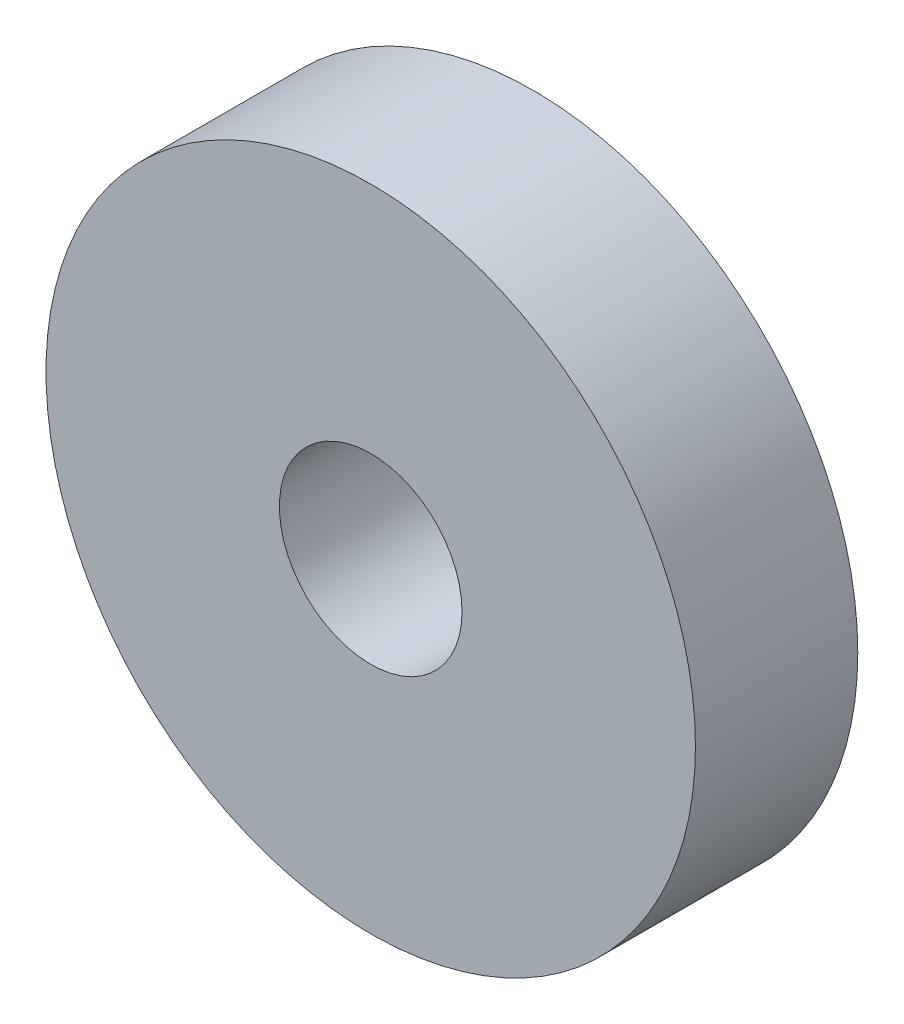
ISO-10303-21;
HEADER;
FILE_DESCRIPTION(('STEP AP214'),'2;1');
FILE_NAME('part.step','',(''),(''),'','','');
FILE_SCHEMA(('AUTOMOTIVE_DESIGN { 1 0 10303 214 1 1 1 1 }'));
ENDSEC;
DATA;
#1=APPLICATION_CONTEXT('core data for automotive mechanical design processes');
#2=APPLICATION_PROTOCOL_DEFINITION('international standard','automotive_design',2000,#1);
#3=PRODUCT_CONTEXT('',#1,'mechanical');
#4=PRODUCT('Part','Part','',(#3));
#5=PRODUCT_RELATED_PRODUCT_CATEGORY('part','',(#4));
#6=PRODUCT_DEFINITION_FORMATION('','',#4);
#7=PRODUCT_DEFINITION_CONTEXT('part definition',#1,'design');
#8=PRODUCT_DEFINITION('design','',#6,#7);
#9=PRODUCT_DEFINITION_SHAPE('','',#8);
#10=(LENGTH_UNIT() NAMED_UNIT(*) SI_UNIT(.MILLI.,.METRE.));
#11=(NAMED_UNIT(*) PLANE_ANGLE_UNIT() SI_UNIT($,.RADIAN.));
#12=(NAMED_UNIT(*) SI_UNIT($,.STERADIAN.) SOLID_ANGLE_UNIT());
#13=UNCERTAINTY_MEASURE_WITH_UNIT(LENGTH_MEASURE(1.E-05),#10,'distance_accuracy_value','');
#14=(GEOMETRIC_REPRESENTATION_CONTEXT(3) GLOBAL_UNCERTAINTY_ASSIGNED_CONTEXT((#13)) GLOBAL_UNIT_ASSIGNED_CONTEXT((#10,
#11,#12)) REPRESENTATION_CONTEXT('',''));
#15=CARTESIAN_POINT('',(0.,0.,0.));
#16=DIRECTION('',(0.,0.,1.));
#17=DIRECTION('',(1.,0.,0.));
#18=AXIS2_PLACEMENT_3D('',#15,#16,#17);
#19=CARTESIAN_POINT('',(0.,0.,25.4));
#20=DIRECTION('',(0.,0.,1.));
#21=DIRECTION('',(1.,0.,0.));
#22=AXIS2_PLACEMENT_3D('',#19,#20,#21);
#23=PLANE('',#22);
#24=CARTESIAN_POINT('',(0.,0.,25.4));
#25=DIRECTION('',(0.,0.,1.));
#26=DIRECTION('',(1.,0.,0.));
#27=AXIS2_PLACEMENT_3D('',#24,#25,#26);
#28=CIRCLE('',#27,50.8);
#29=CARTESIAN_POINT('',(50.8,0.,25.4));
#30=VERTEX_POINT('',#29);
#31=EDGE_CURVE('E10',#30,#30,#28,.T.);
#32=ORIENTED_EDGE('',*,*,#31,.T.);
#33=EDGE_LOOP('',(#32));
#34=FACE_BOUND('',#33,.T.);
#35=CARTESIAN_POINT('',(0.,0.,25.4));
#36=DIRECTION('',(0.,0.,1.));
#37=DIRECTION('',(1.,0.,0.));
#38=AXIS2_PLACEMENT_3D('',#35,#36,#37);
#39=CIRCLE('',#38,14.2875);
#40=CARTESIAN_POINT('',(14.2875,0.,25.4));
#41=VERTEX_POINT('',#40);
#42=EDGE_CURVE('E56',#41,#41,#39,.T.);
#43=ORIENTED_EDGE('',*,*,#42,.F.);
#44=EDGE_LOOP('',(#43));
#45=FACE_BOUND('',#44,.T.);
#46=ADVANCED_FACE('F43',(#34,#45),#23,.T.);
#47=CARTESIAN_POINT('',(0.,0.,0.));
#48=DIRECTION('',(0.,0.,1.));
#49=DIRECTION('',(1.,0.,0.));
#50=AXIS2_PLACEMENT_3D('',#47,#48,#49);
#51=PLANE('',#50);
#52=CARTESIAN_POINT('',(0.,0.,0.));
#53=DIRECTION('',(0.,0.,1.));
#54=DIRECTION('',(1.,0.,0.));
#55=AXIS2_PLACEMENT_3D('',#52,#53,#54);
#56=CIRCLE('',#55,50.8);
#57=CARTESIAN_POINT('',(50.8,0.,0.));
#58=VERTEX_POINT('',#57);
#59=EDGE_CURVE('E47',#58,#58,#56,.T.);
#60=ORIENTED_EDGE('',*,*,#59,.F.);
#61=EDGE_LOOP('',(#60));
#62=FACE_BOUND('',#61,.T.);
#63=CARTESIAN_POINT('',(0.,0.,0.));
#64=DIRECTION('',(0.,0.,1.));
#65=DIRECTION('',(1.,0.,0.));
#66=AXIS2_PLACEMENT_3D('',#63,#64,#65);
#67=CIRCLE('',#66,14.2875);
#68=CARTESIAN_POINT('',(14.2875,0.,0.));
#69=VERTEX_POINT('',#68);
#70=EDGE_CURVE('E58',#69,#69,#67,.T.);
#71=ORIENTED_EDGE('',*,*,#70,.T.);
#72=EDGE_LOOP('',(#71));
#73=FACE_BOUND('',#72,.T.);
#74=ADVANCED_FACE('F70',(#62,#73),#51,.F.);
#75=CARTESIAN_POINT('',(0.,0.,25.4));
#76=DIRECTION('',(0.,0.,-1.));
#77=DIRECTION('',(-1.,0.,0.));
#78=AXIS2_PLACEMENT_3D('',#75,#76,#77);
#79=CYLINDRICAL_SURFACE('',#78,50.8);
#80=ORIENTED_EDGE('',*,*,#31,.F.);
#81=EDGE_LOOP('',(#80));
#82=FACE_BOUND('',#81,.T.);
#83=ORIENTED_EDGE('',*,*,#59,.T.);
#84=EDGE_LOOP('',(#83));
#85=FACE_BOUND('',#84,.T.);
#86=ADVANCED_FACE('F45',(#82,#85),#79,.T.);
#87=CARTESIAN_POINT('',(0.,0.,25.4));
#88=DIRECTION('',(0.,0.,-1.));
#89=DIRECTION('',(-1.,0.,0.));
#90=AXIS2_PLACEMENT_3D('',#87,#88,#89);
#91=CYLINDRICAL_SURFACE('',#90,14.2875);
#92=ORIENTED_EDGE('',*,*,#42,.T.);
#93=EDGE_LOOP('',(#92));
#94=FACE_BOUND('',#93,.T.);
#95=ORIENTED_EDGE('',*,*,#70,.F.);
#96=EDGE_LOOP('',(#95));
#97=FACE_BOUND('',#96,.T.);
#98=ADVANCED_FACE('F66',(#94,#97),#91,.F.);
#99=CLOSED_SHELL('',(#46,#74,#86,#98));
#100=MANIFOLD_SOLID_BREP('B2',#99);
#101=ADVANCED_BREP_SHAPE_REPRESENTATION('',(#18,#100),#14);
#102=SHAPE_DEFINITION_REPRESENTATION(#9,#101);
ENDSEC;
END-ISO-10303-21;
